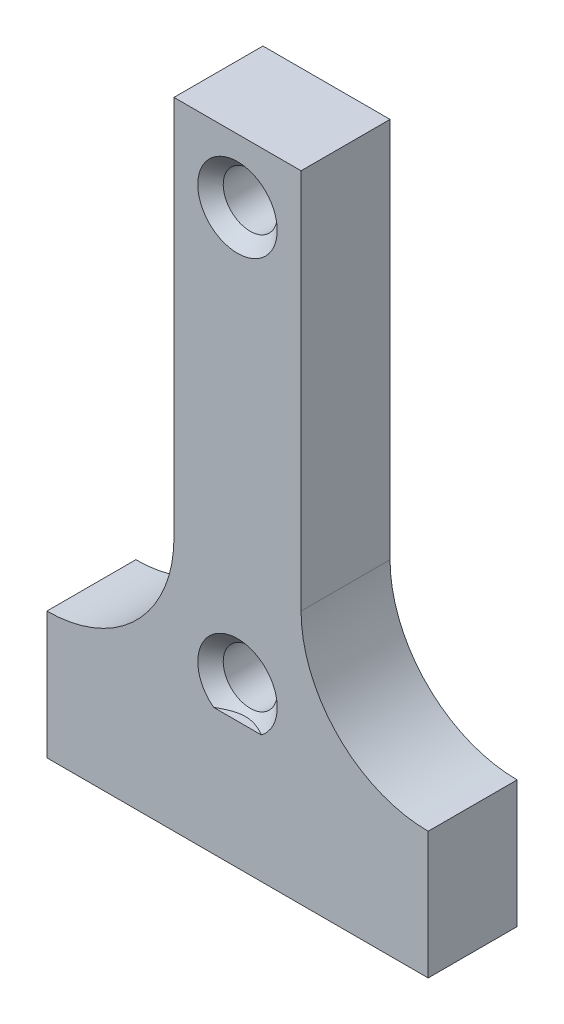
ISO-10303-21;
HEADER;
FILE_DESCRIPTION(('STEP AP214'),'2;1');
FILE_NAME('part.step','',(''),(''),'','','');
FILE_SCHEMA(('AUTOMOTIVE_DESIGN { 1 0 10303 214 1 1 1 1 }'));
ENDSEC;
DATA;
#1=APPLICATION_CONTEXT('core data for automotive mechanical design processes');
#2=APPLICATION_PROTOCOL_DEFINITION('international standard','automotive_design',2000,#1);
#3=PRODUCT_CONTEXT('',#1,'mechanical');
#4=PRODUCT('Part','Part','',(#3));
#5=PRODUCT_RELATED_PRODUCT_CATEGORY('part','',(#4));
#6=PRODUCT_DEFINITION_FORMATION('','',#4);
#7=PRODUCT_DEFINITION_CONTEXT('part definition',#1,'design');
#8=PRODUCT_DEFINITION('design','',#6,#7);
#9=PRODUCT_DEFINITION_SHAPE('','',#8);
#10=(LENGTH_UNIT() NAMED_UNIT(*) SI_UNIT(.MILLI.,.METRE.));
#11=(NAMED_UNIT(*) PLANE_ANGLE_UNIT() SI_UNIT($,.RADIAN.));
#12=(NAMED_UNIT(*) SI_UNIT($,.STERADIAN.) SOLID_ANGLE_UNIT());
#13=UNCERTAINTY_MEASURE_WITH_UNIT(LENGTH_MEASURE(1.E-05),#10,'distance_accuracy_value','');
#14=(GEOMETRIC_REPRESENTATION_CONTEXT(3) GLOBAL_UNCERTAINTY_ASSIGNED_CONTEXT((#13)) GLOBAL_UNIT_ASSIGNED_CONTEXT((#10,
#11,#12)) REPRESENTATION_CONTEXT('',''));
#15=CARTESIAN_POINT('',(0.,0.,0.));
#16=DIRECTION('',(0.,0.,1.));
#17=DIRECTION('',(1.,0.,0.));
#18=AXIS2_PLACEMENT_3D('',#15,#16,#17);
#19=CARTESIAN_POINT('',(0.,0.,7.));
#20=DIRECTION('',(1.,0.,0.));
#21=DIRECTION('',(0.,0.,-1.));
#22=AXIS2_PLACEMENT_3D('',#19,#20,#21);
#23=PLANE('',#22);
#24=DIRECTION('',(0.,-1.,0.));
#25=VECTOR('',#24,1.);
#26=CARTESIAN_POINT('',(0.,0.,0.));
#27=LINE('',#26,#25);
#28=CARTESIAN_POINT('',(0.,40.,0.));
#29=VERTEX_POINT('',#28);
#30=CARTESIAN_POINT('',(0.,10.,0.));
#31=VERTEX_POINT('',#30);
#32=EDGE_CURVE('E146',#29,#31,#27,.T.);
#33=ORIENTED_EDGE('',*,*,#32,.T.);
#34=DIRECTION('',(0.,0.,-1.));
#35=VECTOR('',#34,1.);
#36=CARTESIAN_POINT('',(0.,10.,7.));
#37=LINE('',#36,#35);
#38=CARTESIAN_POINT('',(0.,10.,7.));
#39=VERTEX_POINT('',#38);
#40=EDGE_CURVE('E206',#31,#39,#37,.F.);
#41=ORIENTED_EDGE('',*,*,#40,.T.);
#42=DIRECTION('',(0.,-1.,0.));
#43=VECTOR('',#42,1.);
#44=CARTESIAN_POINT('',(0.,0.,7.));
#45=LINE('',#44,#43);
#46=CARTESIAN_POINT('',(0.,40.,7.));
#47=VERTEX_POINT('',#46);
#48=EDGE_CURVE('E153',#47,#39,#45,.T.);
#49=ORIENTED_EDGE('',*,*,#48,.F.);
#50=DIRECTION('',(0.,0.,-1.));
#51=VECTOR('',#50,1.);
#52=CARTESIAN_POINT('',(0.,40.,7.));
#53=LINE('',#52,#51);
#54=EDGE_CURVE('E160',#47,#29,#53,.T.);
#55=ORIENTED_EDGE('',*,*,#54,.T.);
#56=EDGE_LOOP('',(#33,#41,#49,#55));
#57=FACE_BOUND('',#56,.T.);
#58=ADVANCED_FACE('F43',(#57),#23,.F.);
#59=CARTESIAN_POINT('',(10.,0.,7.));
#60=DIRECTION('',(-1.,0.,0.));
#61=DIRECTION('',(0.,-1.,0.));
#62=AXIS2_PLACEMENT_3D('',#59,#60,#61);
#63=PLANE('',#62);
#64=DIRECTION('',(0.,1.,0.));
#65=VECTOR('',#64,1.);
#66=CARTESIAN_POINT('',(10.,0.,7.));
#67=LINE('',#66,#65);
#68=CARTESIAN_POINT('',(10.,10.,7.));
#69=VERTEX_POINT('',#68);
#70=CARTESIAN_POINT('',(10.,40.,7.));
#71=VERTEX_POINT('',#70);
#72=EDGE_CURVE('E155',#69,#71,#67,.T.);
#73=ORIENTED_EDGE('',*,*,#72,.F.);
#74=DIRECTION('',(0.,0.,-1.));
#75=VECTOR('',#74,1.);
#76=CARTESIAN_POINT('',(10.,10.,0.));
#77=LINE('',#76,#75);
#78=CARTESIAN_POINT('',(10.,10.,0.));
#79=VERTEX_POINT('',#78);
#80=EDGE_CURVE('E218',#69,#79,#77,.T.);
#81=ORIENTED_EDGE('',*,*,#80,.T.);
#82=DIRECTION('',(0.,1.,0.));
#83=VECTOR('',#82,1.);
#84=CARTESIAN_POINT('',(10.,0.,0.));
#85=LINE('',#84,#83);
#86=CARTESIAN_POINT('',(10.,40.,0.));
#87=VERTEX_POINT('',#86);
#88=EDGE_CURVE('E162',#79,#87,#85,.T.);
#89=ORIENTED_EDGE('',*,*,#88,.T.);
#90=DIRECTION('',(0.,0.,-1.));
#91=VECTOR('',#90,1.);
#92=CARTESIAN_POINT('',(10.,40.,7.));
#93=LINE('',#92,#91);
#94=EDGE_CURVE('E170',#71,#87,#93,.T.);
#95=ORIENTED_EDGE('',*,*,#94,.F.);
#96=EDGE_LOOP('',(#73,#81,#89,#95));
#97=FACE_BOUND('',#96,.T.);
#98=ADVANCED_FACE('F198',(#97),#63,.F.);
#99=CARTESIAN_POINT('',(0.,40.,7.));
#100=DIRECTION('',(0.,-1.,0.));
#101=DIRECTION('',(0.,0.,-1.));
#102=AXIS2_PLACEMENT_3D('',#99,#100,#101);
#103=PLANE('',#102);
#104=DIRECTION('',(-1.,0.,0.));
#105=VECTOR('',#104,1.);
#106=CARTESIAN_POINT('',(0.,40.,0.));
#107=LINE('',#106,#105);
#108=EDGE_CURVE('E151',#87,#29,#107,.T.);
#109=ORIENTED_EDGE('',*,*,#108,.T.);
#110=ORIENTED_EDGE('',*,*,#54,.F.);
#111=DIRECTION('',(-1.,0.,0.));
#112=VECTOR('',#111,1.);
#113=CARTESIAN_POINT('',(0.,40.,7.));
#114=LINE('',#113,#112);
#115=EDGE_CURVE('E159',#71,#47,#114,.T.);
#116=ORIENTED_EDGE('',*,*,#115,.F.);
#117=ORIENTED_EDGE('',*,*,#94,.T.);
#118=EDGE_LOOP('',(#109,#110,#116,#117));
#119=FACE_BOUND('',#118,.T.);
#120=ADVANCED_FACE('F205',(#119),#103,.F.);
#121=CARTESIAN_POINT('',(0.,0.,7.));
#122=DIRECTION('',(0.,0.,-1.));
#123=DIRECTION('',(-1.,0.,0.));
#124=AXIS2_PLACEMENT_3D('',#121,#122,#123);
#125=PLANE('',#124);
#126=DIRECTION('',(0.,1.,0.));
#127=VECTOR('',#126,1.);
#128=CARTESIAN_POINT('',(20.,-10.,7.));
#129=LINE('',#128,#127);
#130=CARTESIAN_POINT('',(20.,-10.,7.));
#131=VERTEX_POINT('',#130);
#132=CARTESIAN_POINT('',(20.,0.,7.));
#133=VERTEX_POINT('',#132);
#134=EDGE_CURVE('E144',#131,#133,#129,.T.);
#135=ORIENTED_EDGE('',*,*,#134,.T.);
#136=CARTESIAN_POINT('',(20.,10.,7.));
#137=DIRECTION('',(0.,0.,-1.));
#138=DIRECTION('',(-1.,0.,0.));
#139=AXIS2_PLACEMENT_3D('',#136,#137,#138);
#140=CIRCLE('',#139,10.);
#141=EDGE_CURVE('E11',#133,#69,#140,.T.);
#142=ORIENTED_EDGE('',*,*,#141,.T.);
#143=ORIENTED_EDGE('',*,*,#72,.T.);
#144=ORIENTED_EDGE('',*,*,#115,.T.);
#145=ORIENTED_EDGE('',*,*,#48,.T.);
#146=CARTESIAN_POINT('',(-10.,10.,7.));
#147=DIRECTION('',(0.,0.,-1.));
#148=DIRECTION('',(-1.,0.,0.));
#149=AXIS2_PLACEMENT_3D('',#146,#147,#148);
#150=CIRCLE('',#149,10.);
#151=CARTESIAN_POINT('',(-10.,0.,7.));
#152=VERTEX_POINT('',#151);
#153=EDGE_CURVE('E213',#39,#152,#150,.T.);
#154=ORIENTED_EDGE('',*,*,#153,.T.);
#155=DIRECTION('',(0.,1.,0.));
#156=VECTOR('',#155,1.);
#157=CARTESIAN_POINT('',(-10.,-10.,7.));
#158=LINE('',#157,#156);
#159=CARTESIAN_POINT('',(-10.,-10.,7.));
#160=VERTEX_POINT('',#159);
#161=EDGE_CURVE('E235',#160,#152,#158,.T.);
#162=ORIENTED_EDGE('',*,*,#161,.F.);
#163=DIRECTION('',(-1.,0.,0.));
#164=VECTOR('',#163,1.);
#165=CARTESIAN_POINT('',(-10.,-10.,7.));
#166=LINE('',#165,#164);
#167=EDGE_CURVE('E128',#131,#160,#166,.T.);
#168=ORIENTED_EDGE('',*,*,#167,.F.);
#169=EDGE_LOOP('',(#135,#142,#143,#144,#145,#154,#162,#168));
#170=FACE_BOUND('',#169,.T.);
#171=CARTESIAN_POINT('',(5.,35.,7.));
#172=DIRECTION('',(0.,0.,-1.));
#173=DIRECTION('',(-1.,0.,0.));
#174=AXIS2_PLACEMENT_3D('',#171,#172,#173);
#175=CIRCLE('',#174,3.125);
#176=CARTESIAN_POINT('',(1.87500000000001,35.,7.));
#177=VERTEX_POINT('',#176);
#178=EDGE_CURVE('E173',#177,#177,#175,.T.);
#179=ORIENTED_EDGE('',*,*,#178,.T.);
#180=EDGE_LOOP('',(#179));
#181=FACE_BOUND('',#180,.T.);
#182=CARTESIAN_POINT('',(5.,2.5,7.));
#183=DIRECTION('',(0.,0.,-1.));
#184=DIRECTION('',(-1.,0.,0.));
#185=AXIS2_PLACEMENT_3D('',#182,#183,#184);
#186=CIRCLE('',#185,3.125);
#187=CARTESIAN_POINT('',(3.12500000000001,0.,7.));
#188=VERTEX_POINT('',#187);
#189=CARTESIAN_POINT('',(6.875,0.,7.));
#190=VERTEX_POINT('',#189);
#191=EDGE_CURVE('E176',#188,#190,#186,.T.);
#192=ORIENTED_EDGE('',*,*,#191,.T.);
#193=DIRECTION('',(-1.,0.,0.));
#194=VECTOR('',#193,1.);
#195=CARTESIAN_POINT('',(-10.,0.,7.));
#196=LINE('',#195,#194);
#197=EDGE_CURVE('E135',#190,#188,#196,.T.);
#198=ORIENTED_EDGE('',*,*,#197,.T.);
#199=EDGE_LOOP('',(#192,#198));
#200=FACE_BOUND('',#199,.T.);
#201=ADVANCED_FACE('F231',(#170,#181,#200),#125,.F.);
#202=CARTESIAN_POINT('',(0.,0.,0.));
#203=DIRECTION('',(0.,0.,-1.));
#204=DIRECTION('',(-1.,0.,0.));
#205=AXIS2_PLACEMENT_3D('',#202,#203,#204);
#206=PLANE('',#205);
#207=CARTESIAN_POINT('',(5.,35.,0.));
#208=DIRECTION('',(0.,0.,1.));
#209=DIRECTION('',(1.,0.,0.));
#210=AXIS2_PLACEMENT_3D('',#207,#208,#209);
#211=CIRCLE('',#210,2.125);
#212=CARTESIAN_POINT('',(7.12500000000001,35.,0.));
#213=VERTEX_POINT('',#212);
#214=EDGE_CURVE('E145',#213,#213,#211,.T.);
#215=ORIENTED_EDGE('',*,*,#214,.T.);
#216=EDGE_LOOP('',(#215));
#217=FACE_BOUND('',#216,.T.);
#218=CARTESIAN_POINT('',(5.,2.5,0.));
#219=DIRECTION('',(0.,0.,1.));
#220=DIRECTION('',(1.,0.,0.));
#221=AXIS2_PLACEMENT_3D('',#218,#219,#220);
#222=CIRCLE('',#221,2.125);
#223=CARTESIAN_POINT('',(7.125,2.5,0.));
#224=VERTEX_POINT('',#223);
#225=EDGE_CURVE('E140',#224,#224,#222,.T.);
#226=ORIENTED_EDGE('',*,*,#225,.T.);
#227=EDGE_LOOP('',(#226));
#228=FACE_BOUND('',#227,.T.);
#229=ORIENTED_EDGE('',*,*,#32,.F.);
#230=ORIENTED_EDGE('',*,*,#108,.F.);
#231=ORIENTED_EDGE('',*,*,#88,.F.);
#232=CARTESIAN_POINT('',(20.,10.,0.));
#233=DIRECTION('',(0.,0.,-1.));
#234=DIRECTION('',(-1.,0.,0.));
#235=AXIS2_PLACEMENT_3D('',#232,#233,#234);
#236=CIRCLE('',#235,10.);
#237=CARTESIAN_POINT('',(20.,0.,0.));
#238=VERTEX_POINT('',#237);
#239=EDGE_CURVE('E51',#79,#238,#236,.F.);
#240=ORIENTED_EDGE('',*,*,#239,.T.);
#241=DIRECTION('',(0.,1.,0.));
#242=VECTOR('',#241,1.);
#243=CARTESIAN_POINT('',(20.,-10.,0.));
#244=LINE('',#243,#242);
#245=CARTESIAN_POINT('',(20.,-10.,0.));
#246=VERTEX_POINT('',#245);
#247=EDGE_CURVE('E122',#246,#238,#244,.T.);
#248=ORIENTED_EDGE('',*,*,#247,.F.);
#249=DIRECTION('',(1.,0.,0.));
#250=VECTOR('',#249,1.);
#251=CARTESIAN_POINT('',(-10.,-10.,0.));
#252=LINE('',#251,#250);
#253=CARTESIAN_POINT('',(-10.,-10.,0.));
#254=VERTEX_POINT('',#253);
#255=EDGE_CURVE('E113',#254,#246,#252,.T.);
#256=ORIENTED_EDGE('',*,*,#255,.F.);
#257=DIRECTION('',(0.,1.,0.));
#258=VECTOR('',#257,1.);
#259=CARTESIAN_POINT('',(-10.,-10.,0.));
#260=LINE('',#259,#258);
#261=CARTESIAN_POINT('',(-10.,0.,0.));
#262=VERTEX_POINT('',#261);
#263=EDGE_CURVE('E117',#254,#262,#260,.T.);
#264=ORIENTED_EDGE('',*,*,#263,.T.);
#265=CARTESIAN_POINT('',(-10.,10.,0.));
#266=DIRECTION('',(0.,0.,-1.));
#267=DIRECTION('',(-1.,0.,0.));
#268=AXIS2_PLACEMENT_3D('',#265,#266,#267);
#269=CIRCLE('',#268,10.);
#270=EDGE_CURVE('E211',#262,#31,#269,.F.);
#271=ORIENTED_EDGE('',*,*,#270,.T.);
#272=EDGE_LOOP('',(#229,#230,#231,#240,#248,#256,#264,#271));
#273=FACE_BOUND('',#272,.T.);
#274=ADVANCED_FACE('F116',(#217,#228,#273),#206,.T.);
#275=CARTESIAN_POINT('',(5.,2.5,0.));
#276=DIRECTION('',(0.,0.,1.));
#277=DIRECTION('',(1.,0.,0.));
#278=AXIS2_PLACEMENT_3D('',#275,#276,#277);
#279=CYLINDRICAL_SURFACE('',#278,2.125);
#280=CARTESIAN_POINT('',(5.,2.5,6.00000000000001));
#281=DIRECTION('',(0.,0.,-1.));
#282=DIRECTION('',(-1.,0.,0.));
#283=AXIS2_PLACEMENT_3D('',#280,#281,#282);
#284=CIRCLE('',#283,2.125);
#285=CARTESIAN_POINT('',(2.875,2.5,6.00000000000001));
#286=VERTEX_POINT('',#285);
#287=EDGE_CURVE('E167',#286,#286,#284,.F.);
#288=ORIENTED_EDGE('',*,*,#287,.T.);
#289=EDGE_LOOP('',(#288));
#290=FACE_BOUND('',#289,.T.);
#291=ORIENTED_EDGE('',*,*,#225,.F.);
#292=EDGE_LOOP('',(#291));
#293=FACE_BOUND('',#292,.T.);
#294=ADVANCED_FACE('F250',(#290,#293),#279,.F.);
#295=CARTESIAN_POINT('',(5.,35.,0.));
#296=DIRECTION('',(0.,0.,1.));
#297=DIRECTION('',(1.,0.,0.));
#298=AXIS2_PLACEMENT_3D('',#295,#296,#297);
#299=CYLINDRICAL_SURFACE('',#298,2.125);
#300=CARTESIAN_POINT('',(5.,35.,6.00000000000001));
#301=DIRECTION('',(0.,0.,-1.));
#302=DIRECTION('',(-1.,0.,0.));
#303=AXIS2_PLACEMENT_3D('',#300,#301,#302);
#304=CIRCLE('',#303,2.125);
#305=CARTESIAN_POINT('',(2.875,35.,6.00000000000001));
#306=VERTEX_POINT('',#305);
#307=EDGE_CURVE('E190',#306,#306,#304,.F.);
#308=ORIENTED_EDGE('',*,*,#307,.T.);
#309=EDGE_LOOP('',(#308));
#310=FACE_BOUND('',#309,.T.);
#311=ORIENTED_EDGE('',*,*,#214,.F.);
#312=EDGE_LOOP('',(#311));
#313=FACE_BOUND('',#312,.T.);
#314=ADVANCED_FACE('F252',(#310,#313),#299,.F.);
#315=CARTESIAN_POINT('',(5.,2.5,6.00000000000001));
#316=DIRECTION('',(0.,0.,1.));
#317=DIRECTION('',(1.,0.,0.));
#318=AXIS2_PLACEMENT_3D('',#315,#316,#317);
#319=CONICAL_SURFACE('',#318,2.125,0.785398163397448);
#320=CARTESIAN_POINT('',(6.875,0.,7.));
#321=CARTESIAN_POINT('',(6.78299630520393,0.,6.9448621939265));
#322=CARTESIAN_POINT('',(6.68983253607617,0.,6.89150348809033));
#323=CARTESIAN_POINT('',(6.50044969395728,0.,6.78959251365247));
#324=CARTESIAN_POINT('',(6.40421997136849,0.,6.74106014136281));
#325=CARTESIAN_POINT('',(6.20692583124732,0.,6.64969165765829));
#326=CARTESIAN_POINT('',(6.10580545181801,0.,6.60697443661942));
#327=CARTESIAN_POINT('',(5.90033500864451,0.,6.53047388975531));
#328=CARTESIAN_POINT('',(5.79599017122416,0.,6.49667687524367));
#329=CARTESIAN_POINT('',(5.61723989402969,0.,6.44911088899047));
#330=CARTESIAN_POINT('',(5.54362339249354,0.,6.43238229887873));
#331=CARTESIAN_POINT('',(5.39524755846394,0.,6.40500196637349));
#332=CARTESIAN_POINT('',(5.32048821237358,0.,6.39435029633759));
#333=CARTESIAN_POINT('',(5.17098167963037,0.,6.37974585805428));
#334=CARTESIAN_POINT('',(5.09624031821112,0.,6.37573425525081));
#335=CARTESIAN_POINT('',(4.94670160231859,0.,6.37445014220105));
#336=CARTESIAN_POINT('',(4.87190424989876,0.,6.37717739585694));
#337=CARTESIAN_POINT('',(4.72298734050904,0.,6.38920704011441));
#338=CARTESIAN_POINT('',(4.64886677676988,0.,6.39849711159456));
#339=CARTESIAN_POINT('',(4.50165934219089,0.,6.42315014276454));
#340=CARTESIAN_POINT('',(4.4285725839355,0.,6.4385137586868));
#341=CARTESIAN_POINT('',(4.21018981692093,0.,6.49298334283413));
#342=CARTESIAN_POINT('',(4.06692312456605,0.,6.54035728424974));
#343=CARTESIAN_POINT('',(3.85666020783702,0.,6.62327807041224));
#344=CARTESIAN_POINT('',(3.78718982409439,0.,6.6529776915865));
#345=CARTESIAN_POINT('',(3.64972741635748,0.,6.71568702826691));
#346=CARTESIAN_POINT('',(3.58173565774574,0.,6.74869733210216));
#347=CARTESIAN_POINT('',(3.44824061435869,0.,6.81688865410586));
#348=CARTESIAN_POINT('',(3.38271490134805,0.,6.85202629620406));
#349=CARTESIAN_POINT('',(3.25294425537463,0.,6.92448092291087));
#350=CARTESIAN_POINT('',(3.18869835752465,0.,6.96179617536094));
#351=CARTESIAN_POINT('',(3.12500000000001,0.,7.));
#352=B_SPLINE_CURVE_WITH_KNOTS('',3,(#320,#321,#322,#323,#324,#325,#326,#327,#328,#329,#330,
#331,#332,#333,#334,#335,#336,#337,#338,#339,#340,#341,#342,#343,#344,#345,#346,#347,#348,#349,
#350,#351),.UNSPECIFIED.,.F.,.F.,(4,2,2,2,2,2,2,2,2,2,2,2,2,2,2,4),(0.,0.321883463469458,
0.645043190205004,0.97404726709205,1.30254348924495,1.52880458271795,1.75506837021485,
1.97931639218931,2.20355655767989,2.42737691467148,2.65122146154786,3.10234432582605,
3.32895874492533,3.55561350642647,3.77862817410314,4.00146780301438),.UNSPECIFIED.);
#353=EDGE_CURVE('E177',#190,#188,#352,.T.);
#354=ORIENTED_EDGE('',*,*,#353,.F.);
#355=ORIENTED_EDGE('',*,*,#191,.F.);
#356=EDGE_LOOP('',(#354,#355));
#357=FACE_BOUND('',#356,.T.);
#358=ORIENTED_EDGE('',*,*,#287,.F.);
#359=EDGE_LOOP('',(#358));
#360=FACE_BOUND('',#359,.T.);
#361=ADVANCED_FACE('F188',(#357,#360),#319,.F.);
#362=CARTESIAN_POINT('',(5.,35.,6.00000000000001));
#363=DIRECTION('',(0.,0.,1.));
#364=DIRECTION('',(1.,0.,0.));
#365=AXIS2_PLACEMENT_3D('',#362,#363,#364);
#366=CONICAL_SURFACE('',#365,2.125,0.785398163397448);
#367=ORIENTED_EDGE('',*,*,#178,.F.);
#368=EDGE_LOOP('',(#367));
#369=FACE_BOUND('',#368,.T.);
#370=ORIENTED_EDGE('',*,*,#307,.F.);
#371=EDGE_LOOP('',(#370));
#372=FACE_BOUND('',#371,.T.);
#373=ADVANCED_FACE('F262',(#369,#372),#366,.F.);
#374=CARTESIAN_POINT('',(0.,0.,0.));
#375=DIRECTION('',(0.,-1.,0.));
#376=DIRECTION('',(0.,0.,-1.));
#377=AXIS2_PLACEMENT_3D('',#374,#375,#376);
#378=PLANE('',#377);
#379=ORIENTED_EDGE('',*,*,#197,.F.);
#380=ORIENTED_EDGE('',*,*,#353,.T.);
#381=EDGE_LOOP('',(#379,#380));
#382=FACE_BOUND('',#381,.T.);
#383=ADVANCED_FACE('F259',(#382),#378,.F.);
#384=CARTESIAN_POINT('',(-10.,-10.,7.));
#385=DIRECTION('',(1.,0.,0.));
#386=DIRECTION('',(0.,0.,-1.));
#387=AXIS2_PLACEMENT_3D('',#384,#385,#386);
#388=PLANE('',#387);
#389=DIRECTION('',(0.,0.,-1.));
#390=VECTOR('',#389,1.);
#391=CARTESIAN_POINT('',(-10.,0.,7.));
#392=LINE('',#391,#390);
#393=EDGE_CURVE('E137',#152,#262,#392,.T.);
#394=ORIENTED_EDGE('',*,*,#393,.T.);
#395=ORIENTED_EDGE('',*,*,#263,.F.);
#396=DIRECTION('',(0.,0.,-1.));
#397=VECTOR('',#396,1.);
#398=CARTESIAN_POINT('',(-10.,-10.,7.));
#399=LINE('',#398,#397);
#400=EDGE_CURVE('E123',#160,#254,#399,.T.);
#401=ORIENTED_EDGE('',*,*,#400,.F.);
#402=ORIENTED_EDGE('',*,*,#161,.T.);
#403=EDGE_LOOP('',(#394,#395,#401,#402));
#404=FACE_BOUND('',#403,.T.);
#405=ADVANCED_FACE('F138',(#404),#388,.F.);
#406=CARTESIAN_POINT('',(20.,-10.,7.));
#407=DIRECTION('',(-1.,0.,0.));
#408=DIRECTION('',(0.,0.,1.));
#409=AXIS2_PLACEMENT_3D('',#406,#407,#408);
#410=PLANE('',#409);
#411=DIRECTION('',(0.,0.,1.));
#412=VECTOR('',#411,1.);
#413=CARTESIAN_POINT('',(20.,0.,7.));
#414=LINE('',#413,#412);
#415=EDGE_CURVE('E221',#238,#133,#414,.T.);
#416=ORIENTED_EDGE('',*,*,#415,.T.);
#417=ORIENTED_EDGE('',*,*,#134,.F.);
#418=DIRECTION('',(0.,0.,1.));
#419=VECTOR('',#418,1.);
#420=CARTESIAN_POINT('',(20.,-10.,7.));
#421=LINE('',#420,#419);
#422=EDGE_CURVE('E121',#246,#131,#421,.T.);
#423=ORIENTED_EDGE('',*,*,#422,.F.);
#424=ORIENTED_EDGE('',*,*,#247,.T.);
#425=EDGE_LOOP('',(#416,#417,#423,#424));
#426=FACE_BOUND('',#425,.T.);
#427=ADVANCED_FACE('F222',(#426),#410,.F.);
#428=CARTESIAN_POINT('',(0.,-10.,0.));
#429=DIRECTION('',(0.,-1.,0.));
#430=DIRECTION('',(0.,0.,-1.));
#431=AXIS2_PLACEMENT_3D('',#428,#429,#430);
#432=PLANE('',#431);
#433=ORIENTED_EDGE('',*,*,#400,.T.);
#434=ORIENTED_EDGE('',*,*,#255,.T.);
#435=ORIENTED_EDGE('',*,*,#422,.T.);
#436=ORIENTED_EDGE('',*,*,#167,.T.);
#437=EDGE_LOOP('',(#433,#434,#435,#436));
#438=FACE_BOUND('',#437,.T.);
#439=ADVANCED_FACE('F129',(#438),#432,.T.);
#440=CARTESIAN_POINT('',(-10.,10.,0.));
#441=DIRECTION('',(0.,0.,1.));
#442=DIRECTION('',(1.,0.,0.));
#443=AXIS2_PLACEMENT_3D('',#440,#441,#442);
#444=CYLINDRICAL_SURFACE('',#443,10.);
#445=ORIENTED_EDGE('',*,*,#153,.F.);
#446=ORIENTED_EDGE('',*,*,#40,.F.);
#447=ORIENTED_EDGE('',*,*,#270,.F.);
#448=ORIENTED_EDGE('',*,*,#393,.F.);
#449=EDGE_LOOP('',(#445,#446,#447,#448));
#450=FACE_BOUND('',#449,.T.);
#451=ADVANCED_FACE('F214',(#450),#444,.F.);
#452=CARTESIAN_POINT('',(20.,10.,7.));
#453=DIRECTION('',(0.,0.,1.));
#454=DIRECTION('',(1.,0.,0.));
#455=AXIS2_PLACEMENT_3D('',#452,#453,#454);
#456=CYLINDRICAL_SURFACE('',#455,10.);
#457=ORIENTED_EDGE('',*,*,#141,.F.);
#458=ORIENTED_EDGE('',*,*,#415,.F.);
#459=ORIENTED_EDGE('',*,*,#239,.F.);
#460=ORIENTED_EDGE('',*,*,#80,.F.);
#461=EDGE_LOOP('',(#457,#458,#459,#460));
#462=FACE_BOUND('',#461,.T.);
#463=ADVANCED_FACE('F44',(#462),#456,.F.);
#464=CLOSED_SHELL('',(#58,#98,#120,#201,#274,#294,#314,#361,#373,#383,#405,#427,#439,#451,#463));
#465=MANIFOLD_SOLID_BREP('B2',#464);
#466=ADVANCED_BREP_SHAPE_REPRESENTATION('',(#18,#465),#14);
#467=SHAPE_DEFINITION_REPRESENTATION(#9,#466);
ENDSEC;
END-ISO-10303-21;
